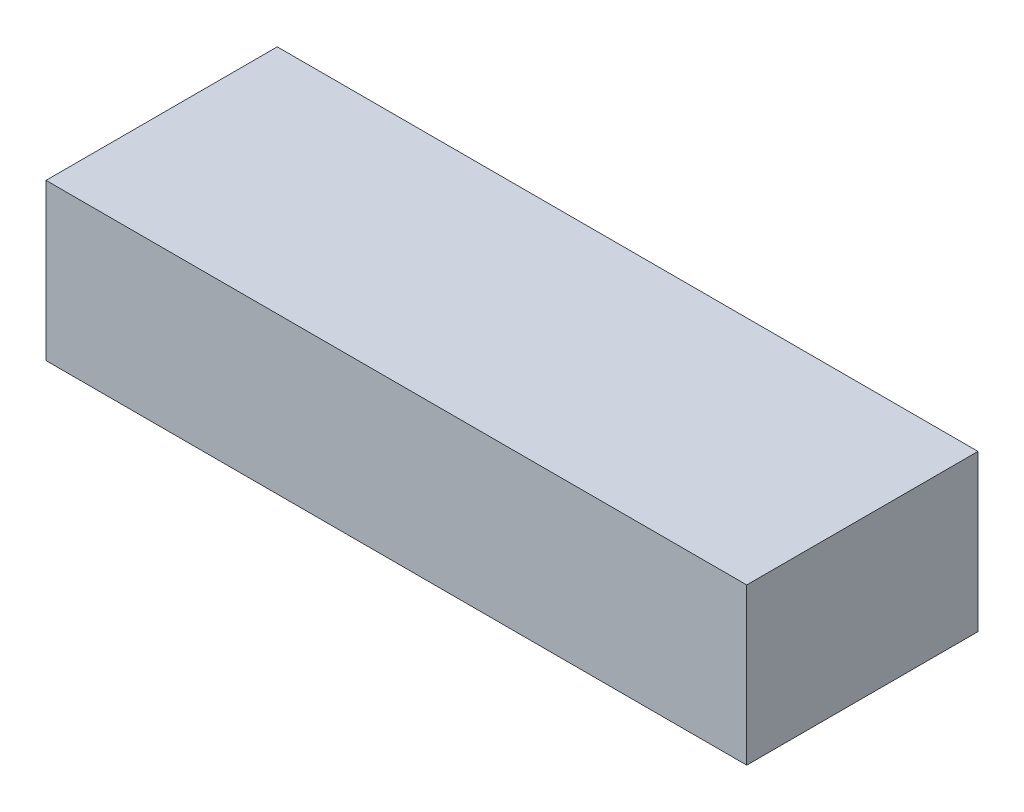
ISO-10303-21;
HEADER;
FILE_DESCRIPTION(('STEP AP214'),'2;1');
FILE_NAME('part.step','',(''),(''),'','','');
FILE_SCHEMA(('AUTOMOTIVE_DESIGN { 1 0 10303 214 1 1 1 1 }'));
ENDSEC;
DATA;
#1=APPLICATION_CONTEXT('core data for automotive mechanical design processes');
#2=APPLICATION_PROTOCOL_DEFINITION('international standard','automotive_design',2000,#1);
#3=PRODUCT_CONTEXT('',#1,'mechanical');
#4=PRODUCT('Part','Part','',(#3));
#5=PRODUCT_RELATED_PRODUCT_CATEGORY('part','',(#4));
#6=PRODUCT_DEFINITION_FORMATION('','',#4);
#7=PRODUCT_DEFINITION_CONTEXT('part definition',#1,'design');
#8=PRODUCT_DEFINITION('design','',#6,#7);
#9=PRODUCT_DEFINITION_SHAPE('','',#8);
#10=(LENGTH_UNIT() NAMED_UNIT(*) SI_UNIT(.MILLI.,.METRE.));
#11=(NAMED_UNIT(*) PLANE_ANGLE_UNIT() SI_UNIT($,.RADIAN.));
#12=(NAMED_UNIT(*) SI_UNIT($,.STERADIAN.) SOLID_ANGLE_UNIT());
#13=UNCERTAINTY_MEASURE_WITH_UNIT(LENGTH_MEASURE(1.E-05),#10,'distance_accuracy_value','');
#14=(GEOMETRIC_REPRESENTATION_CONTEXT(3) GLOBAL_UNCERTAINTY_ASSIGNED_CONTEXT((#13)) GLOBAL_UNIT_ASSIGNED_CONTEXT((#10,
#11,#12)) REPRESENTATION_CONTEXT('',''));
#15=CARTESIAN_POINT('',(0.,0.,0.));
#16=DIRECTION('',(0.,0.,1.));
#17=DIRECTION('',(1.,0.,0.));
#18=AXIS2_PLACEMENT_3D('',#15,#16,#17);
#19=CARTESIAN_POINT('',(76.962,34.29,25.4));
#20=DIRECTION('',(-1.,0.,0.));
#21=DIRECTION('',(0.,0.,1.));
#22=AXIS2_PLACEMENT_3D('',#19,#20,#21);
#23=PLANE('',#22);
#24=DIRECTION('',(0.,0.,-1.));
#25=VECTOR('',#24,1.);
#26=CARTESIAN_POINT('',(76.962,0.,25.4));
#27=LINE('',#26,#25);
#28=CARTESIAN_POINT('',(76.962,0.,25.4));
#29=VERTEX_POINT('',#28);
#30=CARTESIAN_POINT('',(76.962,0.,-25.4));
#31=VERTEX_POINT('',#30);
#32=EDGE_CURVE('E107',#29,#31,#27,.T.);
#33=ORIENTED_EDGE('',*,*,#32,.T.);
#34=DIRECTION('',(0.,-1.,0.));
#35=VECTOR('',#34,1.);
#36=CARTESIAN_POINT('',(76.962,34.29,-25.4));
#37=LINE('',#36,#35);
#38=CARTESIAN_POINT('',(76.962,34.29,-25.4));
#39=VERTEX_POINT('',#38);
#40=EDGE_CURVE('E11',#39,#31,#37,.T.);
#41=ORIENTED_EDGE('',*,*,#40,.F.);
#42=DIRECTION('',(0.,0.,-1.));
#43=VECTOR('',#42,1.);
#44=CARTESIAN_POINT('',(76.962,34.29,25.4));
#45=LINE('',#44,#43);
#46=CARTESIAN_POINT('',(76.962,34.29,25.4));
#47=VERTEX_POINT('',#46);
#48=EDGE_CURVE('E90',#47,#39,#45,.T.);
#49=ORIENTED_EDGE('',*,*,#48,.F.);
#50=DIRECTION('',(0.,-1.,0.));
#51=VECTOR('',#50,1.);
#52=CARTESIAN_POINT('',(76.962,34.29,25.4));
#53=LINE('',#52,#51);
#54=EDGE_CURVE('E103',#47,#29,#53,.T.);
#55=ORIENTED_EDGE('',*,*,#54,.T.);
#56=EDGE_LOOP('',(#33,#41,#49,#55));
#57=FACE_BOUND('',#56,.T.);
#58=ADVANCED_FACE('F38',(#57),#23,.F.);
#59=CARTESIAN_POINT('',(-76.962,34.29,-25.4));
#60=DIRECTION('',(0.,0.,1.));
#61=DIRECTION('',(1.,0.,0.));
#62=AXIS2_PLACEMENT_3D('',#59,#60,#61);
#63=PLANE('',#62);
#64=DIRECTION('',(-1.,0.,0.));
#65=VECTOR('',#64,1.);
#66=CARTESIAN_POINT('',(-76.962,0.,-25.4));
#67=LINE('',#66,#65);
#68=CARTESIAN_POINT('',(-76.962,0.,-25.4));
#69=VERTEX_POINT('',#68);
#70=EDGE_CURVE('E95',#31,#69,#67,.T.);
#71=ORIENTED_EDGE('',*,*,#70,.T.);
#72=DIRECTION('',(0.,-1.,0.));
#73=VECTOR('',#72,1.);
#74=CARTESIAN_POINT('',(-76.962,34.29,-25.4));
#75=LINE('',#74,#73);
#76=CARTESIAN_POINT('',(-76.962,34.29,-25.4));
#77=VERTEX_POINT('',#76);
#78=EDGE_CURVE('E47',#77,#69,#75,.T.);
#79=ORIENTED_EDGE('',*,*,#78,.F.);
#80=DIRECTION('',(-1.,0.,0.));
#81=VECTOR('',#80,1.);
#82=CARTESIAN_POINT('',(-76.962,34.29,-25.4));
#83=LINE('',#82,#81);
#84=EDGE_CURVE('E85',#39,#77,#83,.T.);
#85=ORIENTED_EDGE('',*,*,#84,.F.);
#86=ORIENTED_EDGE('',*,*,#40,.T.);
#87=EDGE_LOOP('',(#71,#79,#85,#86));
#88=FACE_BOUND('',#87,.T.);
#89=ADVANCED_FACE('F94',(#88),#63,.F.);
#90=CARTESIAN_POINT('',(-76.962,34.29,25.4));
#91=DIRECTION('',(1.,0.,0.));
#92=DIRECTION('',(0.,0.,-1.));
#93=AXIS2_PLACEMENT_3D('',#90,#91,#92);
#94=PLANE('',#93);
#95=DIRECTION('',(0.,0.,1.));
#96=VECTOR('',#95,1.);
#97=CARTESIAN_POINT('',(-76.962,0.,25.4));
#98=LINE('',#97,#96);
#99=CARTESIAN_POINT('',(-76.962,0.,25.4));
#100=VERTEX_POINT('',#99);
#101=EDGE_CURVE('E72',#69,#100,#98,.T.);
#102=ORIENTED_EDGE('',*,*,#101,.T.);
#103=DIRECTION('',(0.,-1.,0.));
#104=VECTOR('',#103,1.);
#105=CARTESIAN_POINT('',(-76.962,34.29,25.4));
#106=LINE('',#105,#104);
#107=CARTESIAN_POINT('',(-76.962,34.29,25.4));
#108=VERTEX_POINT('',#107);
#109=EDGE_CURVE('E97',#108,#100,#106,.T.);
#110=ORIENTED_EDGE('',*,*,#109,.F.);
#111=DIRECTION('',(0.,0.,1.));
#112=VECTOR('',#111,1.);
#113=CARTESIAN_POINT('',(-76.962,34.29,25.4));
#114=LINE('',#113,#112);
#115=EDGE_CURVE('E88',#77,#108,#114,.T.);
#116=ORIENTED_EDGE('',*,*,#115,.F.);
#117=ORIENTED_EDGE('',*,*,#78,.T.);
#118=EDGE_LOOP('',(#102,#110,#116,#117));
#119=FACE_BOUND('',#118,.T.);
#120=ADVANCED_FACE('F98',(#119),#94,.F.);
#121=CARTESIAN_POINT('',(-76.962,34.29,25.4));
#122=DIRECTION('',(0.,0.,-1.));
#123=DIRECTION('',(-1.,0.,0.));
#124=AXIS2_PLACEMENT_3D('',#121,#122,#123);
#125=PLANE('',#124);
#126=DIRECTION('',(1.,0.,0.));
#127=VECTOR('',#126,1.);
#128=CARTESIAN_POINT('',(-76.962,0.,25.4));
#129=LINE('',#128,#127);
#130=EDGE_CURVE('E78',#100,#29,#129,.T.);
#131=ORIENTED_EDGE('',*,*,#130,.T.);
#132=ORIENTED_EDGE('',*,*,#54,.F.);
#133=DIRECTION('',(1.,0.,0.));
#134=VECTOR('',#133,1.);
#135=CARTESIAN_POINT('',(-76.962,34.29,25.4));
#136=LINE('',#135,#134);
#137=EDGE_CURVE('E55',#108,#47,#136,.T.);
#138=ORIENTED_EDGE('',*,*,#137,.F.);
#139=ORIENTED_EDGE('',*,*,#109,.T.);
#140=EDGE_LOOP('',(#131,#132,#138,#139));
#141=FACE_BOUND('',#140,.T.);
#142=ADVANCED_FACE('F121',(#141),#125,.F.);
#143=CARTESIAN_POINT('',(0.,34.29,0.));
#144=DIRECTION('',(0.,-1.,0.));
#145=DIRECTION('',(0.,0.,-1.));
#146=AXIS2_PLACEMENT_3D('',#143,#144,#145);
#147=PLANE('',#146);
#148=ORIENTED_EDGE('',*,*,#48,.T.);
#149=ORIENTED_EDGE('',*,*,#84,.T.);
#150=ORIENTED_EDGE('',*,*,#115,.T.);
#151=ORIENTED_EDGE('',*,*,#137,.T.);
#152=EDGE_LOOP('',(#148,#149,#150,#151));
#153=FACE_BOUND('',#152,.T.);
#154=ADVANCED_FACE('F86',(#153),#147,.F.);
#155=CARTESIAN_POINT('',(0.,0.,0.));
#156=DIRECTION('',(0.,-1.,0.));
#157=DIRECTION('',(0.,0.,-1.));
#158=AXIS2_PLACEMENT_3D('',#155,#156,#157);
#159=PLANE('',#158);
#160=ORIENTED_EDGE('',*,*,#32,.F.);
#161=ORIENTED_EDGE('',*,*,#130,.F.);
#162=ORIENTED_EDGE('',*,*,#101,.F.);
#163=ORIENTED_EDGE('',*,*,#70,.F.);
#164=EDGE_LOOP('',(#160,#161,#162,#163));
#165=FACE_BOUND('',#164,.T.);
#166=ADVANCED_FACE('F124',(#165),#159,.T.);
#167=CLOSED_SHELL('',(#58,#89,#120,#142,#154,#166));
#168=MANIFOLD_SOLID_BREP('B2',#167);
#169=ADVANCED_BREP_SHAPE_REPRESENTATION('',(#18,#168),#14);
#170=SHAPE_DEFINITION_REPRESENTATION(#9,#169);
ENDSEC;
END-ISO-10303-21;
